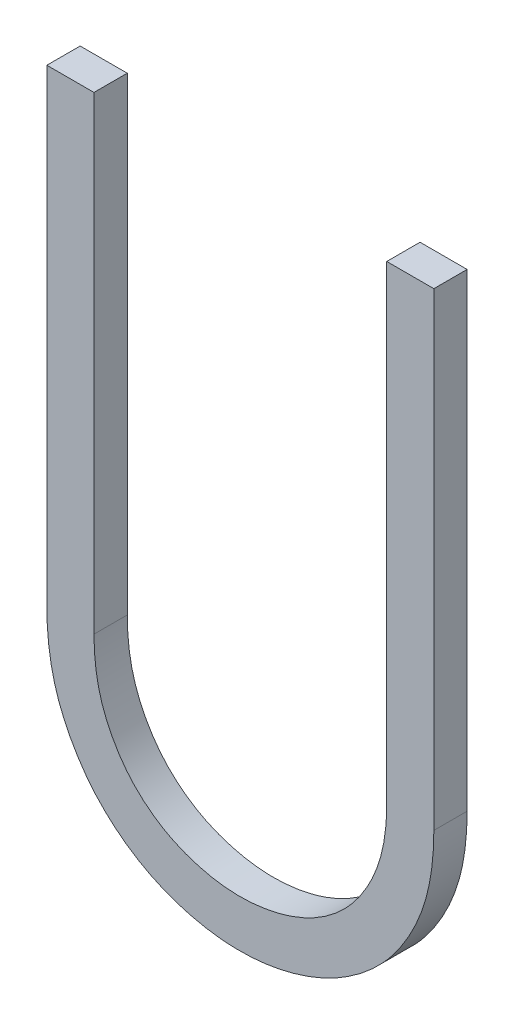
ISO-10303-21;
HEADER;
FILE_DESCRIPTION(('STEP AP214'),'2;1');
FILE_NAME('part.step','',(''),(''),'','','');
FILE_SCHEMA(('AUTOMOTIVE_DESIGN { 1 0 10303 214 1 1 1 1 }'));
ENDSEC;
DATA;
#1=APPLICATION_CONTEXT('core data for automotive mechanical design processes');
#2=APPLICATION_PROTOCOL_DEFINITION('international standard','automotive_design',2000,#1);
#3=PRODUCT_CONTEXT('',#1,'mechanical');
#4=PRODUCT('Part','Part','',(#3));
#5=PRODUCT_RELATED_PRODUCT_CATEGORY('part','',(#4));
#6=PRODUCT_DEFINITION_FORMATION('','',#4);
#7=PRODUCT_DEFINITION_CONTEXT('part definition',#1,'design');
#8=PRODUCT_DEFINITION('design','',#6,#7);
#9=PRODUCT_DEFINITION_SHAPE('','',#8);
#10=(LENGTH_UNIT() NAMED_UNIT(*) SI_UNIT(.MILLI.,.METRE.));
#11=(NAMED_UNIT(*) PLANE_ANGLE_UNIT() SI_UNIT($,.RADIAN.));
#12=(NAMED_UNIT(*) SI_UNIT($,.STERADIAN.) SOLID_ANGLE_UNIT());
#13=UNCERTAINTY_MEASURE_WITH_UNIT(LENGTH_MEASURE(1.E-05),#10,'distance_accuracy_value','');
#14=(GEOMETRIC_REPRESENTATION_CONTEXT(3) GLOBAL_UNCERTAINTY_ASSIGNED_CONTEXT((#13)) GLOBAL_UNIT_ASSIGNED_CONTEXT((#10,
#11,#12)) REPRESENTATION_CONTEXT('',''));
#15=CARTESIAN_POINT('',(0.,0.,0.));
#16=DIRECTION('',(0.,0.,1.));
#17=DIRECTION('',(1.,0.,0.));
#18=AXIS2_PLACEMENT_3D('',#15,#16,#17);
#19=CARTESIAN_POINT('',(92.5469384686771,61.768082354778,-39.1));
#20=DIRECTION('',(0.,0.,-1.));
#21=DIRECTION('',(-1.,0.,0.));
#22=AXIS2_PLACEMENT_3D('',#19,#20,#21);
#23=PLANE('',#22);
#24=DIRECTION('',(0.,1.,0.));
#25=VECTOR('',#24,1.);
#26=CARTESIAN_POINT('',(93.1284643788903,62.3727971944111,-39.1));
#27=LINE('',#26,#25);
#28=CARTESIAN_POINT('',(93.1284643788903,63.7819511472511,-39.1));
#29=VERTEX_POINT('',#28);
#30=CARTESIAN_POINT('',(93.1284643788903,62.3727971944111,-39.1));
#31=VERTEX_POINT('',#30);
#32=EDGE_CURVE('E111',#29,#31,#27,.F.);
#33=ORIENTED_EDGE('',*,*,#32,.T.);
#34=CARTESIAN_POINT('',(93.1284643788903,62.3727971944111,-39.1));
#35=CARTESIAN_POINT('',(93.128464612406,62.3559610228039,-39.1));
#36=CARTESIAN_POINT('',(93.1279891828892,62.3391170753176,-39.1));
#37=CARTESIAN_POINT('',(93.1259681334556,62.3054891550443,-39.1));
#38=CARTESIAN_POINT('',(93.1244221550853,62.2887052042387,-39.1));
#39=CARTESIAN_POINT('',(93.1201313363732,62.2552088745833,-39.1));
#40=CARTESIAN_POINT('',(93.117381123898,62.2384971592916,-39.1));
#41=CARTESIAN_POINT('',(93.1104808841553,62.2053813349353,-39.1));
#42=CARTESIAN_POINT('',(93.1063326104776,62.1889768675648,-39.1));
#43=CARTESIAN_POINT('',(93.0965078825521,62.1564927964447,-39.1));
#44=CARTESIAN_POINT('',(93.0908198944745,62.1404166718114,-39.1));
#45=CARTESIAN_POINT('',(93.0780084153976,62.1088338777515,-39.1));
#46=CARTESIAN_POINT('',(93.0708837870614,62.09332767108,-39.1));
#47=CARTESIAN_POINT('',(93.0553284867407,62.0630312545081,-39.1));
#48=CARTESIAN_POINT('',(93.0469007078827,62.0482395515642,-39.1));
#49=CARTESIAN_POINT('',(93.0288450225817,62.0194146253009,-39.1));
#50=CARTESIAN_POINT('',(93.0192177577168,62.0053810022113,-39.1));
#51=CARTESIAN_POINT('',(92.9991350311018,61.9789360156499,-39.1));
#52=CARTESIAN_POINT('',(92.9887393628267,61.9664794767565,-39.1));
#53=CARTESIAN_POINT('',(92.9668482845252,61.9425749980376,-39.1));
#54=CARTESIAN_POINT('',(92.9553527910697,61.9311271348535,-39.1));
#55=CARTESIAN_POINT('',(92.931417153432,61.9092694809057,-39.1));
#56=CARTESIAN_POINT('',(92.9189770224618,61.8988596756281,-39.1));
#57=CARTESIAN_POINT('',(92.893262100626,61.8791121743474,-39.1));
#58=CARTESIAN_POINT('',(92.8799868224904,61.8697751133899,-39.1));
#59=CARTESIAN_POINT('',(92.8532547174539,61.8526104279979,-39.1));
#60=CARTESIAN_POINT('',(92.8398275888469,61.8447366479966,-39.1));
#61=CARTESIAN_POINT('',(92.8123479241951,61.8301570997244,-39.1));
#62=CARTESIAN_POINT('',(92.798295169639,61.8234517436292,-39.1));
#63=CARTESIAN_POINT('',(92.7697022844461,61.8111697438613,-39.1));
#64=CARTESIAN_POINT('',(92.7551620231869,61.8055934055604,-39.1));
#65=CARTESIAN_POINT('',(92.7257062842066,61.7955535969967,-39.1));
#66=CARTESIAN_POINT('',(92.7107907973868,61.7910901537489,-39.1));
#67=CARTESIAN_POINT('',(92.6638440054557,61.778971256608,-39.1));
#68=CARTESIAN_POINT('',(92.6312710912322,61.7733054493397,-39.1));
#69=CARTESIAN_POINT('',(92.5656332714684,61.7674747837131,-39.1));
#70=CARTESIAN_POINT('',(92.5325683781739,61.7673097886634,-39.1));
#71=CARTESIAN_POINT('',(92.482966103109,61.7711726920112,-39.1));
#72=CARTESIAN_POINT('',(92.4662494243451,61.7731907026262,-39.1));
#73=CARTESIAN_POINT('',(92.4330417107069,61.7786377304,-39.1));
#74=CARTESIAN_POINT('',(92.4165507058026,61.7820669331256,-39.1));
#75=CARTESIAN_POINT('',(92.383900743464,61.7902621414913,-39.1));
#76=CARTESIAN_POINT('',(92.3677418993367,61.7950285954336,-39.1));
#77=CARTESIAN_POINT('',(92.3358700675821,61.8058678802424,-39.1));
#78=CARTESIAN_POINT('',(92.3201570034842,61.8119404854947,-39.1));
#79=CARTESIAN_POINT('',(92.2891378120689,61.8255128059834,-39.1));
#80=CARTESIAN_POINT('',(92.2738385025005,61.8330282300943,-39.1));
#81=CARTESIAN_POINT('',(92.2440231471033,61.849483306961,-39.1));
#82=CARTESIAN_POINT('',(92.2295071990375,61.858423136934,-39.1));
#83=CARTESIAN_POINT('',(92.2013592750524,61.8775718225582,-39.1));
#84=CARTESIAN_POINT('',(92.1877265244775,61.8877795425662,-39.1));
#85=CARTESIAN_POINT('',(92.1614521423162,61.9093974587848,-39.1));
#86=CARTESIAN_POINT('',(92.1488103508913,61.9208074603724,-39.1));
#87=CARTESIAN_POINT('',(92.1256633258928,61.9437437820867,-39.1));
#88=CARTESIAN_POINT('',(92.1150678188181,61.9551789642454,-39.1));
#89=CARTESIAN_POINT('',(92.0949386801385,61.9789471721373,-39.1));
#90=CARTESIAN_POINT('',(92.0854049799097,61.9912801397618,-39.1));
#91=CARTESIAN_POINT('',(92.067394872686,62.0166858610574,-39.1));
#92=CARTESIAN_POINT('',(92.0589181450619,62.0297583886275,-39.1));
#93=CARTESIAN_POINT('',(92.0429520399606,62.056489904101,-39.1));
#94=CARTESIAN_POINT('',(92.0354629174173,62.0701490422266,-39.1));
#95=CARTESIAN_POINT('',(92.0142816860538,62.1127175245262,-39.1));
#96=CARTESIAN_POINT('',(92.0023533166285,62.1425519956378,-39.1));
#97=CARTESIAN_POINT('',(91.9884829559134,62.1884739050831,-39.1));
#98=CARTESIAN_POINT('',(91.9845286846697,62.2039860697985,-39.1));
#99=CARTESIAN_POINT('',(91.9778825541651,62.2352795321276,-39.1));
#100=CARTESIAN_POINT('',(91.9751907309663,62.251060837416,-39.1));
#101=CARTESIAN_POINT('',(91.9706609308811,62.2844805898403,-39.1));
#102=CARTESIAN_POINT('',(91.9689468483553,62.3021352303027,-39.1));
#103=CARTESIAN_POINT('',(91.9667139858682,62.3374624856035,-39.1));
#104=CARTESIAN_POINT('',(91.9661912408522,62.3551348443925,-39.1));
#105=CARTESIAN_POINT('',(91.9661897602903,62.3727971944111,-39.1));
#106=B_SPLINE_CURVE_WITH_KNOTS('',3,(#34,#35,#36,#37,#38,#39,#40,#41,#42,#43,#44,#45,#46,#47,
#48,#49,#50,#51,#52,#53,#54,#55,#56,#57,#58,#59,#60,#61,#62,#63,#64,#65,#66,#67,#68,#69,#70,#71,
#72,#73,#74,#75,#76,#77,#78,#79,#80,#81,#82,#83,#84,#85,#86,#87,#88,#89,#90,#91,#92,#93,#94,#95,
#96,#97,#98,#99,#100,#101,#102,#103,#104,#105),.UNSPECIFIED.,.F.,.F.,(4,2,2,2,2,2,2,2,2,2,2,2,2,
2,2,2,2,2,2,2,2,2,2,2,2,2,2,2,2,2,2,2,2,2,2,4),(0.,0.0505131126021044,0.101043146770105,
0.151800931149548,0.20249528547167,0.253580429140989,0.304706175009595,0.355720004416848,
0.406706663872336,0.455308685788363,0.503914397413702,0.55251942935277,0.601153087947299,
0.647795101440344,0.694453535308416,0.741124572335233,0.787796742165514,0.886506132827456,
0.985213070631072,1.03567639126356,1.08614634977205,1.1366332481707,1.18711143285614,
1.23817404723261,1.28924301952228,1.34026657503558,1.39128188360503,1.43799042280603,
1.48469594151162,1.53138725760076,1.57809060278417,1.67393094600677,1.72190973269508,
1.76988988982616,1.82306131187261,1.87605550670264),.UNSPECIFIED.);
#107=CARTESIAN_POINT('',(91.9661897602903,62.3727971944111,-39.1));
#108=VERTEX_POINT('',#107);
#109=EDGE_CURVE('E84',#31,#108,#106,.T.);
#110=ORIENTED_EDGE('',*,*,#109,.T.);
#111=DIRECTION('',(0.,1.,0.));
#112=VECTOR('',#111,1.);
#113=CARTESIAN_POINT('',(91.9661897602903,61.768082354778,-39.1));
#114=LINE('',#113,#112);
#115=CARTESIAN_POINT('',(91.9661897602903,63.7819511472511,-39.1));
#116=VERTEX_POINT('',#115);
#117=EDGE_CURVE('E82',#108,#116,#114,.T.);
#118=ORIENTED_EDGE('',*,*,#117,.T.);
#119=DIRECTION('',(1.,0.,0.));
#120=VECTOR('',#119,1.);
#121=CARTESIAN_POINT('',(92.1076599405903,63.7819511472511,-39.1));
#122=LINE('',#121,#120);
#123=CARTESIAN_POINT('',(92.1076599405903,63.7819511472511,-39.1));
#124=VERTEX_POINT('',#123);
#125=EDGE_CURVE('E78',#116,#124,#122,.T.);
#126=ORIENTED_EDGE('',*,*,#125,.T.);
#127=DIRECTION('',(0.,1.,0.));
#128=VECTOR('',#127,1.);
#129=CARTESIAN_POINT('',(92.1076599405903,62.3727971944111,-39.1));
#130=LINE('',#129,#128);
#131=CARTESIAN_POINT('',(92.1076599405903,62.3727971944111,-39.1));
#132=VERTEX_POINT('',#131);
#133=EDGE_CURVE('E72',#124,#132,#130,.F.);
#134=ORIENTED_EDGE('',*,*,#133,.T.);
#135=CARTESIAN_POINT('',(92.1076599405903,62.3727971944111,-39.1));
#136=CARTESIAN_POINT('',(92.1076789981272,62.3558384894153,-39.1));
#137=CARTESIAN_POINT('',(92.1082609739383,62.3388574954336,-39.1));
#138=CARTESIAN_POINT('',(92.1108215180757,62.3049362087749,-39.1));
#139=CARTESIAN_POINT('',(92.112805694954,62.2879963546022,-39.1));
#140=CARTESIAN_POINT('',(92.1184558302516,62.2543202873392,-39.1));
#141=CARTESIAN_POINT('',(92.1221278914652,62.2375850414001,-39.1));
#142=CARTESIAN_POINT('',(92.1314507900277,62.204703382027,-39.1));
#143=CARTESIAN_POINT('',(92.1370976273427,62.1885558505962,-39.1));
#144=CARTESIAN_POINT('',(92.148232906288,62.1618146888392,-39.1));
#145=CARTESIAN_POINT('',(92.1532506466588,62.1510210584086,-39.1));
#146=CARTESIAN_POINT('',(92.164117073467,62.1298511205019,-39.1));
#147=CARTESIAN_POINT('',(92.1699663581348,62.1194751204342,-39.1));
#148=CARTESIAN_POINT('',(92.1824037498419,62.099212867842,-39.1));
#149=CARTESIAN_POINT('',(92.1889897497277,62.0893253295175,-39.1));
#150=CARTESIAN_POINT('',(92.2029923024783,62.0701689258503,-39.1));
#151=CARTESIAN_POINT('',(92.2104082031219,62.0608995836835,-39.1));
#152=CARTESIAN_POINT('',(92.2339908745917,62.0340822003594,-39.1));
#153=CARTESIAN_POINT('',(92.2514344295387,62.0176226849092,-39.1));
#154=CARTESIAN_POINT('',(92.2795032762778,61.9954121340389,-39.1));
#155=CARTESIAN_POINT('',(92.2891870096989,61.9884162237661,-39.1));
#156=CARTESIAN_POINT('',(92.3091161819004,61.9752757077272,-39.1));
#157=CARTESIAN_POINT('',(92.3193612902052,61.9691306084553,-39.1));
#158=CARTESIAN_POINT('',(92.3398258621346,61.9580996761413,-39.1));
#159=CARTESIAN_POINT('',(92.3500191452628,61.9531650905835,-39.1));
#160=CARTESIAN_POINT('',(92.3707697385443,61.9441288415465,-39.1));
#161=CARTESIAN_POINT('',(92.3813271777594,61.9400274769952,-39.1));
#162=CARTESIAN_POINT('',(92.4027048127613,61.9325813054758,-39.1));
#163=CARTESIAN_POINT('',(92.4135250315432,61.9292365649833,-39.1));
#164=CARTESIAN_POINT('',(92.4353661785707,61.9232876570716,-39.1));
#165=CARTESIAN_POINT('',(92.4463871030346,61.9206834757134,-39.1));
#166=CARTESIAN_POINT('',(92.4700779752161,61.9159460584293,-39.1));
#167=CARTESIAN_POINT('',(92.4827705109812,61.9139231272964,-39.1));
#168=CARTESIAN_POINT('',(92.5082801207616,61.9109904937692,-39.1));
#169=CARTESIAN_POINT('',(92.5210971798394,61.9100806594718,-39.1));
#170=CARTESIAN_POINT('',(92.5596004421889,61.9090174681615,-39.1));
#171=CARTESIAN_POINT('',(92.585349644283,61.9105282189676,-39.1));
#172=CARTESIAN_POINT('',(92.6361651503735,61.9176555332605,-39.1));
#173=CARTESIAN_POINT('',(92.661233053235,61.923261430938,-39.1));
#174=CARTESIAN_POINT('',(92.7102228492542,61.9382912977695,-39.1));
#175=CARTESIAN_POINT('',(92.7341454583794,61.9477128458198,-39.1));
#176=CARTESIAN_POINT('',(92.7802714132852,61.9712576177516,-39.1));
#177=CARTESIAN_POINT('',(92.8024229907752,61.9854833444715,-39.1));
#178=CARTESIAN_POINT('',(92.8436663435529,62.0178444081711,-39.1));
#179=CARTESIAN_POINT('',(92.8627591423771,62.0359784325625,-39.1));
#180=CARTESIAN_POINT('',(92.894473651437,62.0730424727731,-39.1));
#181=CARTESIAN_POINT('',(92.9076226651519,62.0915271329504,-39.1));
#182=CARTESIAN_POINT('',(92.9311483056162,62.1301597856754,-39.1));
#183=CARTESIAN_POINT('',(92.9415259015216,62.1503071935307,-39.1));
#184=CARTESIAN_POINT('',(92.9550619294097,62.1824435569383,-39.1));
#185=CARTESIAN_POINT('',(92.9593536471576,62.1939598622023,-39.1));
#186=CARTESIAN_POINT('',(92.9669358839226,62.2173177403139,-39.1));
#187=CARTESIAN_POINT('',(92.9702263410901,62.2291593332059,-39.1));
#188=CARTESIAN_POINT('',(92.9786285158555,62.2650312106342,-39.1));
#189=CARTESIAN_POINT('',(92.98227203586,62.2894110066692,-39.1));
#190=CARTESIAN_POINT('',(92.9853236763738,62.3236920475392,-39.1));
#191=CARTESIAN_POINT('',(92.985961517582,62.3335201626765,-39.1));
#192=CARTESIAN_POINT('',(92.9867971990121,62.3531629993325,-39.1));
#193=CARTESIAN_POINT('',(92.986996477432,62.3629776588295,-39.1));
#194=CARTESIAN_POINT('',(92.9869941985903,62.3727971944111,-39.1));
#195=B_SPLINE_CURVE_WITH_KNOTS('',3,(#135,#136,#137,#138,#139,#140,#141,#142,#143,#144,#145,
#146,#147,#148,#149,#150,#151,#152,#153,#154,#155,#156,#157,#158,#159,#160,#161,#162,#163,#164,
#165,#166,#167,#168,#169,#170,#171,#172,#173,#174,#175,#176,#177,#178,#179,#180,#181,#182,#183,
#184,#185,#186,#187,#188,#189,#190,#191,#192,#193,#194),.UNSPECIFIED.,.F.,.F.,(4,2,2,2,2,2,2,2,
2,2,2,2,2,2,2,2,2,2,2,2,2,2,2,2,2,2,2,2,2,4),(0.,0.0509009811380191,0.102006717882854,
0.153298706298225,0.204487395630813,0.240161761465519,0.275861923301043,0.311462467447496,
0.347035226956435,0.418517242261074,0.454326971074864,0.490115840949116,0.524050197655469,
0.55799670730169,0.591946198275354,0.625895050201771,0.66440574238388,0.702911870571285,
0.77989117694182,0.856670702327828,0.933401585764448,1.01188556774298,1.09034323210703,
1.15810747598678,1.22584799180842,1.26267542070807,1.29950512403607,1.3731567982994,
1.40269968908229,1.43214555330972),.UNSPECIFIED.);
#196=CARTESIAN_POINT('',(92.9869941985903,62.3727971944111,-39.1));
#197=VERTEX_POINT('',#196);
#198=EDGE_CURVE('E24',#132,#197,#195,.T.);
#199=ORIENTED_EDGE('',*,*,#198,.T.);
#200=DIRECTION('',(0.,1.,0.));
#201=VECTOR('',#200,1.);
#202=CARTESIAN_POINT('',(92.9869941985903,63.7819511472511,-39.1));
#203=LINE('',#202,#201);
#204=CARTESIAN_POINT('',(92.9869941985903,63.7819511472511,-39.1));
#205=VERTEX_POINT('',#204);
#206=EDGE_CURVE('E128',#197,#205,#203,.T.);
#207=ORIENTED_EDGE('',*,*,#206,.T.);
#208=DIRECTION('',(1.,0.,0.));
#209=VECTOR('',#208,1.);
#210=CARTESIAN_POINT('',(93.1284643788903,63.7819511472511,-39.1));
#211=LINE('',#210,#209);
#212=EDGE_CURVE('E115',#205,#29,#211,.T.);
#213=ORIENTED_EDGE('',*,*,#212,.T.);
#214=EDGE_LOOP('',(#33,#110,#118,#126,#134,#199,#207,#213));
#215=FACE_BOUND('',#214,.T.);
#216=ADVANCED_FACE('F17',(#215),#23,.T.);
#217=CARTESIAN_POINT('',(92.1076599405903,63.7819511472511,-39.));
#218=DIRECTION('',(0.,-1.,0.));
#219=DIRECTION('',(0.,0.,-1.));
#220=AXIS2_PLACEMENT_3D('',#217,#218,#219);
#221=PLANE('',#220);
#222=DIRECTION('',(0.,0.,-1.));
#223=VECTOR('',#222,1.);
#224=CARTESIAN_POINT('',(91.9661897602903,63.7819511472511,-39.));
#225=LINE('',#224,#223);
#226=CARTESIAN_POINT('',(91.9661897602903,63.7819511472511,-39.));
#227=VERTEX_POINT('',#226);
#228=EDGE_CURVE('E92',#116,#227,#225,.F.);
#229=ORIENTED_EDGE('',*,*,#228,.T.);
#230=DIRECTION('',(-1.,0.,0.));
#231=VECTOR('',#230,1.);
#232=CARTESIAN_POINT('',(92.5469384686771,63.7819511472511,-39.));
#233=LINE('',#232,#231);
#234=CARTESIAN_POINT('',(92.1076599405903,63.7819511472511,-39.));
#235=VERTEX_POINT('',#234);
#236=EDGE_CURVE('E98',#227,#235,#233,.F.);
#237=ORIENTED_EDGE('',*,*,#236,.T.);
#238=DIRECTION('',(0.,0.,1.));
#239=VECTOR('',#238,1.);
#240=CARTESIAN_POINT('',(92.1076599405903,63.7819511472511,-39.));
#241=LINE('',#240,#239);
#242=EDGE_CURVE('E94',#235,#124,#241,.F.);
#243=ORIENTED_EDGE('',*,*,#242,.T.);
#244=ORIENTED_EDGE('',*,*,#125,.F.);
#245=EDGE_LOOP('',(#229,#237,#243,#244));
#246=FACE_BOUND('',#245,.T.);
#247=ADVANCED_FACE('F90',(#246),#221,.F.);
#248=CARTESIAN_POINT('',(92.1076599405903,62.3727971944111,-39.));
#249=DIRECTION('',(-1.,0.,0.));
#250=DIRECTION('',(0.,0.,1.));
#251=AXIS2_PLACEMENT_3D('',#248,#249,#250);
#252=PLANE('',#251);
#253=ORIENTED_EDGE('',*,*,#242,.F.);
#254=DIRECTION('',(0.,1.,0.));
#255=VECTOR('',#254,1.);
#256=CARTESIAN_POINT('',(92.1076599405903,61.768082354778,-39.));
#257=LINE('',#256,#255);
#258=CARTESIAN_POINT('',(92.1076599405903,62.3727971944111,-39.));
#259=VERTEX_POINT('',#258);
#260=EDGE_CURVE('E106',#235,#259,#257,.F.);
#261=ORIENTED_EDGE('',*,*,#260,.T.);
#262=DIRECTION('',(0.,0.,-1.));
#263=VECTOR('',#262,1.);
#264=CARTESIAN_POINT('',(92.1076599405903,62.3727971944111,-39.05));
#265=LINE('',#264,#263);
#266=EDGE_CURVE('E134',#259,#132,#265,.T.);
#267=ORIENTED_EDGE('',*,*,#266,.T.);
#268=ORIENTED_EDGE('',*,*,#133,.F.);
#269=EDGE_LOOP('',(#253,#261,#267,#268));
#270=FACE_BOUND('',#269,.T.);
#271=ADVANCED_FACE('F191',(#270),#252,.F.);
#272=CARTESIAN_POINT('',(92.9869941985903,62.3727971944111,-39.));
#273=CARTESIAN_POINT('',(92.9869941985903,62.3727971944111,-39.1));
#274=CARTESIAN_POINT('',(92.9869941985903,62.3474314733611,-39.));
#275=CARTESIAN_POINT('',(92.9869941985903,62.3474314733611,-39.1));
#276=CARTESIAN_POINT('',(92.9844516341903,62.2986452045111,-39.));
#277=CARTESIAN_POINT('',(92.9844516341903,62.2986452045111,-39.1));
#278=CARTESIAN_POINT('',(92.9718587119903,62.2289848071911,-39.));
#279=CARTESIAN_POINT('',(92.9718587119903,62.2289848071911,-39.1));
#280=CARTESIAN_POINT('',(92.9500480645903,62.1666240285311,-39.));
#281=CARTESIAN_POINT('',(92.9500480645903,62.1666240285311,-39.1));
#282=CARTESIAN_POINT('',(92.9212677967903,62.1115059303311,-39.));
#283=CARTESIAN_POINT('',(92.9212677967903,62.1115059303311,-39.1));
#284=CARTESIAN_POINT('',(92.8874423864903,62.0627878716211,-39.));
#285=CARTESIAN_POINT('',(92.8874423864903,62.0627878716211,-39.1));
#286=CARTESIAN_POINT('',(92.8480952942903,62.0211861683711,-39.));
#287=CARTESIAN_POINT('',(92.8480952942903,62.0211861683711,-39.1));
#288=CARTESIAN_POINT('',(92.8043264813903,61.9863464067611,-39.));
#289=CARTESIAN_POINT('',(92.8043264813903,61.9863464067611,-39.1));
#290=CARTESIAN_POINT('',(92.7567744393903,61.9578109685211,-39.));
#291=CARTESIAN_POINT('',(92.7567744393903,61.9578109685211,-39.1));
#292=CARTESIAN_POINT('',(92.7058712104903,61.9362960147211,-39.));
#293=CARTESIAN_POINT('',(92.7058712104903,61.9362960147211,-39.1));
#294=CARTESIAN_POINT('',(92.6531627209903,61.9209964694111,-39.));
#295=CARTESIAN_POINT('',(92.6531627209903,61.9209964694111,-39.1));
#296=CARTESIAN_POINT('',(92.5996696579903,61.9116223399711,-39.));
#297=CARTESIAN_POINT('',(92.5996696579903,61.9116223399711,-39.1));
#298=CARTESIAN_POINT('',(92.5464532247903,61.9085184032511,-39.));
#299=CARTESIAN_POINT('',(92.5464532247903,61.9085184032511,-39.1));
#300=CARTESIAN_POINT('',(92.4935405572903,61.9116397945211,-39.));
#301=CARTESIAN_POINT('',(92.4935405572903,61.9116397945211,-39.1));
#302=CARTESIAN_POINT('',(92.4409871583903,61.9210790233511,-39.));
#303=CARTESIAN_POINT('',(92.4409871583903,61.9210790233511,-39.1));
#304=CARTESIAN_POINT('',(92.3886974774903,61.9363488171011,-39.));
#305=CARTESIAN_POINT('',(92.3886974774903,61.9363488171011,-39.1));
#306=CARTESIAN_POINT('',(92.3378781931903,61.9578071502211,-39.));
#307=CARTESIAN_POINT('',(92.3378781931903,61.9578071502211,-39.1));
#308=CARTESIAN_POINT('',(92.2903280652903,61.9863474397011,-39.));
#309=CARTESIAN_POINT('',(92.2903280652903,61.9863474397011,-39.1));
#310=CARTESIAN_POINT('',(92.2465587326903,62.0211858838911,-39.));
#311=CARTESIAN_POINT('',(92.2465587326903,62.0211858838911,-39.1));
#312=CARTESIAN_POINT('',(92.2072117840903,62.0627879513311,-39.));
#313=CARTESIAN_POINT('',(92.2072117840903,62.0627879513311,-39.1));
#314=CARTESIAN_POINT('',(92.1733863333903,62.1115059074511,-39.));
#315=CARTESIAN_POINT('',(92.1733863333903,62.1115059074511,-39.1));
#316=CARTESIAN_POINT('',(92.1446060771903,62.1666240351911,-39.));
#317=CARTESIAN_POINT('',(92.1446060771903,62.1666240351911,-39.1));
#318=CARTESIAN_POINT('',(92.1227954263903,62.2289848052211,-39.));
#319=CARTESIAN_POINT('',(92.1227954263903,62.2289848052211,-39.1));
#320=CARTESIAN_POINT('',(92.1102025051903,62.2986452051411,-39.));
#321=CARTESIAN_POINT('',(92.1102025051903,62.2986452051411,-39.1));
#322=CARTESIAN_POINT('',(92.1076599405903,62.3474314733611,-39.));
#323=CARTESIAN_POINT('',(92.1076599405903,62.3474314733611,-39.1));
#324=CARTESIAN_POINT('',(92.1076599405903,62.3727971944111,-39.));
#325=CARTESIAN_POINT('',(92.1076599405903,62.3727971944111,-39.1));
#326=B_SPLINE_SURFACE_WITH_KNOTS('',3,1,((#272,#273),(#274,#275),(#276,#277),(#278,#279),(#280,
#281),(#282,#283),(#284,#285),(#286,#287),(#288,#289),(#290,#291),(#292,#293),(#294,#295),(#296,
#297),(#298,#299),(#300,#301),(#302,#303),(#304,#305),(#306,#307),(#308,#309),(#310,#311),(#312,
#313),(#314,#315),(#316,#317),(#318,#319),(#320,#321),(#322,#323),(#324,#325)),.UNSPECIFIED.,
.F.,.F.,.F.,(4,1,1,1,1,1,1,1,1,1,1,1,1,1,1,1,1,1,1,1,1,1,1,1,4),(2,2),(0.,0.0531350872704,
0.1020767439254,0.1477807877503,0.1909521236719,0.2319702139487,0.271628852714,0.3104488566396,
0.3488152204029,0.3874306662732,0.425876020402,0.4635572154088,0.5009583521422,0.537285267836,
0.5743305417864,0.6125693337268,0.6511847795971,0.6895511433603,0.728371147286,0.7680297860513,
0.8090478763281,0.8522192122497,0.8979232560746,0.94686491272964,1.),(1.,1.1),.UNSPECIFIED.);
#327=CARTESIAN_POINT('',(92.1076599405903,62.3727971944111,-39.));
#328=CARTESIAN_POINT('',(92.1076789981272,62.3558384894153,-39.));
#329=CARTESIAN_POINT('',(92.1082609739383,62.3388574954336,-39.));
#330=CARTESIAN_POINT('',(92.1108215180757,62.3049362087749,-39.));
#331=CARTESIAN_POINT('',(92.112805694954,62.2879963546022,-39.));
#332=CARTESIAN_POINT('',(92.1184558302516,62.2543202873392,-39.));
#333=CARTESIAN_POINT('',(92.1221278914652,62.2375850414001,-39.));
#334=CARTESIAN_POINT('',(92.1314507900277,62.204703382027,-39.));
#335=CARTESIAN_POINT('',(92.1370976273427,62.1885558505962,-39.));
#336=CARTESIAN_POINT('',(92.148232906288,62.1618146888392,-39.));
#337=CARTESIAN_POINT('',(92.1532506466588,62.1510210584086,-39.));
#338=CARTESIAN_POINT('',(92.164117073467,62.129851120502,-39.));
#339=CARTESIAN_POINT('',(92.1699663581348,62.1194751204342,-39.));
#340=CARTESIAN_POINT('',(92.1824037498419,62.099212867842,-39.));
#341=CARTESIAN_POINT('',(92.1889897497277,62.0893253295175,-39.));
#342=CARTESIAN_POINT('',(92.2029923024783,62.0701689258503,-39.));
#343=CARTESIAN_POINT('',(92.2104082031219,62.0608995836835,-39.));
#344=CARTESIAN_POINT('',(92.2339908745917,62.0340822003594,-39.));
#345=CARTESIAN_POINT('',(92.2514344295387,62.0176226849092,-39.));
#346=CARTESIAN_POINT('',(92.2795032762777,61.9954121340389,-39.));
#347=CARTESIAN_POINT('',(92.2891870096989,61.9884162237661,-39.));
#348=CARTESIAN_POINT('',(92.3091161819004,61.9752757077272,-39.));
#349=CARTESIAN_POINT('',(92.3193612902052,61.9691306084553,-39.));
#350=CARTESIAN_POINT('',(92.3398258621346,61.9580996761413,-39.));
#351=CARTESIAN_POINT('',(92.3500191452628,61.9531650905835,-39.));
#352=CARTESIAN_POINT('',(92.3707697385443,61.9441288415465,-39.));
#353=CARTESIAN_POINT('',(92.3813271777594,61.9400274769952,-39.));
#354=CARTESIAN_POINT('',(92.4027048127613,61.9325813054758,-39.));
#355=CARTESIAN_POINT('',(92.4135250315432,61.9292365649833,-39.));
#356=CARTESIAN_POINT('',(92.4353661785707,61.9232876570716,-39.));
#357=CARTESIAN_POINT('',(92.4463871030345,61.9206834757134,-39.));
#358=CARTESIAN_POINT('',(92.4700779752161,61.9159460584293,-39.));
#359=CARTESIAN_POINT('',(92.4827705109812,61.9139231272964,-39.));
#360=CARTESIAN_POINT('',(92.5082801207617,61.9109904937691,-39.));
#361=CARTESIAN_POINT('',(92.5210971798394,61.9100806594718,-39.));
#362=CARTESIAN_POINT('',(92.559600442189,61.9090174681615,-39.));
#363=CARTESIAN_POINT('',(92.5853496442832,61.9105282189677,-39.));
#364=CARTESIAN_POINT('',(92.6361651503737,61.9176555332606,-39.));
#365=CARTESIAN_POINT('',(92.6612330532353,61.9232614309381,-39.));
#366=CARTESIAN_POINT('',(92.7102228492545,61.9382912977696,-39.));
#367=CARTESIAN_POINT('',(92.7341454583797,61.9477128458199,-39.));
#368=CARTESIAN_POINT('',(92.7802714132855,61.9712576177517,-39.));
#369=CARTESIAN_POINT('',(92.8024229907754,61.9854833444716,-39.));
#370=CARTESIAN_POINT('',(92.8436663435531,62.0178444081712,-39.));
#371=CARTESIAN_POINT('',(92.8627591423772,62.0359784325626,-39.));
#372=CARTESIAN_POINT('',(92.8944736514371,62.0730424727731,-39.));
#373=CARTESIAN_POINT('',(92.9076226651519,62.0915271329505,-39.));
#374=CARTESIAN_POINT('',(92.9311483056163,62.1301597856754,-39.));
#375=CARTESIAN_POINT('',(92.9415259015216,62.1503071935307,-39.));
#376=CARTESIAN_POINT('',(92.9550619294097,62.1824435569383,-39.));
#377=CARTESIAN_POINT('',(92.9593536471576,62.1939598622023,-39.));
#378=CARTESIAN_POINT('',(92.9669358839226,62.2173177403139,-39.));
#379=CARTESIAN_POINT('',(92.9702263410901,62.2291593332058,-39.));
#380=CARTESIAN_POINT('',(92.9786285158555,62.2650312106342,-39.));
#381=CARTESIAN_POINT('',(92.98227203586,62.2894110066691,-39.));
#382=CARTESIAN_POINT('',(92.9853236763738,62.3236920475392,-39.));
#383=CARTESIAN_POINT('',(92.985961517582,62.3335201626765,-39.));
#384=CARTESIAN_POINT('',(92.9867971990121,62.3531629993325,-39.));
#385=CARTESIAN_POINT('',(92.986996477432,62.3629776588295,-39.));
#386=CARTESIAN_POINT('',(92.9869941985903,62.3727971944111,-39.));
#387=B_SPLINE_CURVE_WITH_KNOTS('',3,(#327,#328,#329,#330,#331,#332,#333,#334,#335,#336,#337,
#338,#339,#340,#341,#342,#343,#344,#345,#346,#347,#348,#349,#350,#351,#352,#353,#354,#355,#356,
#357,#358,#359,#360,#361,#362,#363,#364,#365,#366,#367,#368,#369,#370,#371,#372,#373,#374,#375,
#376,#377,#378,#379,#380,#381,#382,#383,#384,#385,#386),.UNSPECIFIED.,.F.,.F.,(4,2,2,2,2,2,2,2,
2,2,2,2,2,2,2,2,2,2,2,2,2,2,2,2,2,2,2,2,2,4),(0.,0.0509009811380191,0.102006717882852,
0.153298706298223,0.204487395630812,0.240161761465513,0.275861923301037,0.311462467447499,
0.347035226956434,0.418517242261063,0.454326971074849,0.490115840949114,0.524050197655473,
0.557996707301683,0.591946198275344,0.625895050201757,0.664405742383922,0.702911870571396,
0.779891176942071,0.856670702328129,0.933401585764822,1.01188556774319,1.09034323210711,
1.15810747598685,1.22584799180843,1.26267542070807,1.29950512403606,1.37315679829937,
1.40269968908227,1.43214555330972),.UNSPECIFIED.);
#388=CARTESIAN_POINT('',(92.9869941985903,62.3727971944111,-39.));
#389=VERTEX_POINT('',#388);
#390=EDGE_CURVE('E165',#259,#389,#387,.T.);
#391=DIRECTION('',(0.,0.,-1.));
#392=VECTOR('',#391,1.);
#393=CARTESIAN_POINT('',(92.9869941985903,62.3727971944111,-39.));
#394=LINE('',#393,#392);
#395=EDGE_CURVE('E131',#389,#197,#394,.T.);
#396=ORIENTED_EDGE('',*,*,#266,.F.);
#397=ORIENTED_EDGE('',*,*,#390,.T.);
#398=ORIENTED_EDGE('',*,*,#395,.T.);
#399=ORIENTED_EDGE('',*,*,#198,.F.);
#400=EDGE_LOOP('',(#396,#397,#398,#399));
#401=FACE_BOUND('',#400,.T.);
#402=ADVANCED_FACE('F189',(#401),#326,.F.);
#403=CARTESIAN_POINT('',(92.9869941985903,63.7819511472511,-39.));
#404=DIRECTION('',(1.,0.,0.));
#405=DIRECTION('',(0.,0.,-1.));
#406=AXIS2_PLACEMENT_3D('',#403,#404,#405);
#407=PLANE('',#406);
#408=ORIENTED_EDGE('',*,*,#395,.F.);
#409=DIRECTION('',(0.,1.,0.));
#410=VECTOR('',#409,1.);
#411=CARTESIAN_POINT('',(92.9869941985903,61.768082354778,-39.));
#412=LINE('',#411,#410);
#413=CARTESIAN_POINT('',(92.9869941985903,63.7819511472511,-39.));
#414=VERTEX_POINT('',#413);
#415=EDGE_CURVE('E122',#389,#414,#412,.T.);
#416=ORIENTED_EDGE('',*,*,#415,.T.);
#417=DIRECTION('',(0.,0.,-1.));
#418=VECTOR('',#417,1.);
#419=CARTESIAN_POINT('',(92.9869941985903,63.7819511472511,-39.));
#420=LINE('',#419,#418);
#421=EDGE_CURVE('E125',#414,#205,#420,.T.);
#422=ORIENTED_EDGE('',*,*,#421,.T.);
#423=ORIENTED_EDGE('',*,*,#206,.F.);
#424=EDGE_LOOP('',(#408,#416,#422,#423));
#425=FACE_BOUND('',#424,.T.);
#426=ADVANCED_FACE('F185',(#425),#407,.F.);
#427=CARTESIAN_POINT('',(93.1284643788903,63.7819511472511,-39.));
#428=DIRECTION('',(0.,-1.,0.));
#429=DIRECTION('',(0.,0.,-1.));
#430=AXIS2_PLACEMENT_3D('',#427,#428,#429);
#431=PLANE('',#430);
#432=ORIENTED_EDGE('',*,*,#421,.F.);
#433=DIRECTION('',(-1.,0.,0.));
#434=VECTOR('',#433,1.);
#435=CARTESIAN_POINT('',(92.5469384686771,63.7819511472511,-39.));
#436=LINE('',#435,#434);
#437=CARTESIAN_POINT('',(93.1284643788903,63.7819511472511,-39.));
#438=VERTEX_POINT('',#437);
#439=EDGE_CURVE('E118',#414,#438,#436,.F.);
#440=ORIENTED_EDGE('',*,*,#439,.T.);
#441=DIRECTION('',(0.,0.,1.));
#442=VECTOR('',#441,1.);
#443=CARTESIAN_POINT('',(93.1284643788903,63.7819511472511,-39.));
#444=LINE('',#443,#442);
#445=EDGE_CURVE('E112',#438,#29,#444,.F.);
#446=ORIENTED_EDGE('',*,*,#445,.T.);
#447=ORIENTED_EDGE('',*,*,#212,.F.);
#448=EDGE_LOOP('',(#432,#440,#446,#447));
#449=FACE_BOUND('',#448,.T.);
#450=ADVANCED_FACE('F181',(#449),#431,.F.);
#451=CARTESIAN_POINT('',(93.1284643788903,62.3727971944111,-39.));
#452=DIRECTION('',(-1.,0.,0.));
#453=DIRECTION('',(0.,0.,1.));
#454=AXIS2_PLACEMENT_3D('',#451,#452,#453);
#455=PLANE('',#454);
#456=ORIENTED_EDGE('',*,*,#445,.F.);
#457=DIRECTION('',(0.,1.,0.));
#458=VECTOR('',#457,1.);
#459=CARTESIAN_POINT('',(93.1284643788903,61.768082354778,-39.));
#460=LINE('',#459,#458);
#461=CARTESIAN_POINT('',(93.1284643788903,62.3727971944111,-39.));
#462=VERTEX_POINT('',#461);
#463=EDGE_CURVE('E121',#438,#462,#460,.F.);
#464=ORIENTED_EDGE('',*,*,#463,.T.);
#465=DIRECTION('',(0.,0.,-1.));
#466=VECTOR('',#465,1.);
#467=CARTESIAN_POINT('',(93.1284643788903,62.3727971944111,-39.05));
#468=LINE('',#467,#466);
#469=EDGE_CURVE('E100',#462,#31,#468,.T.);
#470=ORIENTED_EDGE('',*,*,#469,.T.);
#471=ORIENTED_EDGE('',*,*,#32,.F.);
#472=EDGE_LOOP('',(#456,#464,#470,#471));
#473=FACE_BOUND('',#472,.T.);
#474=ADVANCED_FACE('F178',(#473),#455,.F.);
#475=CARTESIAN_POINT('',(91.9661897602903,62.3727971944111,-39.));
#476=CARTESIAN_POINT('',(91.9661897602903,62.3727971944111,-39.1));
#477=CARTESIAN_POINT('',(91.9661897602903,62.3408434982611,-39.));
#478=CARTESIAN_POINT('',(91.9661897602903,62.3408434982611,-39.1));
#479=CARTESIAN_POINT('',(91.9694925364903,62.2791655001911,-39.));
#480=CARTESIAN_POINT('',(91.9694925364903,62.2791655001911,-39.1));
#481=CARTESIAN_POINT('',(91.9857527867903,62.1908113684011,-39.));
#482=CARTESIAN_POINT('',(91.9857527867903,62.1908113684011,-39.1));
#483=CARTESIAN_POINT('',(92.0138162791903,62.1110575925311,-39.));
#484=CARTESIAN_POINT('',(92.0138162791903,62.1110575925311,-39.1));
#485=CARTESIAN_POINT('',(92.0510064790903,62.0398441140611,-39.));
#486=CARTESIAN_POINT('',(92.0510064790903,62.0398441140611,-39.1));
#487=CARTESIAN_POINT('',(92.0950710892903,61.9762174359911,-39.));
#488=CARTESIAN_POINT('',(92.0950710892903,61.9762174359911,-39.1));
#489=CARTESIAN_POINT('',(92.1464459528903,61.9210824004611,-39.));
#490=CARTESIAN_POINT('',(92.1464459528903,61.9210824004611,-39.1));
#491=CARTESIAN_POINT('',(92.2037490963903,61.8742071888811,-39.));
#492=CARTESIAN_POINT('',(92.2037490963903,61.8742071888811,-39.1));
#493=CARTESIAN_POINT('',(92.2662093577903,61.8354285067111,-39.));
#494=CARTESIAN_POINT('',(92.2662093577903,61.8354285067111,-39.1));
#495=CARTESIAN_POINT('',(92.3331453337903,61.8055699712811,-39.));
#496=CARTESIAN_POINT('',(92.3331453337903,61.8055699712811,-39.1));
#497=CARTESIAN_POINT('',(92.4028287865903,61.7840527273211,-39.));
#498=CARTESIAN_POINT('',(92.4028287865903,61.7840527273211,-39.1));
#499=CARTESIAN_POINT('',(92.4740634406903,61.7709448388211,-39.));
#500=CARTESIAN_POINT('',(92.4740634406903,61.7709448388211,-39.1));
#501=CARTESIAN_POINT('',(92.5459401585903,61.7666509167411,-39.));
#502=CARTESIAN_POINT('',(92.5459401585903,61.7666509167411,-39.1));
#503=CARTESIAN_POINT('',(92.6178165667903,61.7709454198411,-39.));
#504=CARTESIAN_POINT('',(92.6178165667903,61.7709454198411,-39.1));
#505=CARTESIAN_POINT('',(92.6890521565903,61.7840503830411,-39.));
#506=CARTESIAN_POINT('',(92.6890521565903,61.7840503830411,-39.1));
#507=CARTESIAN_POINT('',(92.7587769969903,61.8055927987811,-39.));
#508=CARTESIAN_POINT('',(92.7587769969903,61.8055927987811,-39.1));
#509=CARTESIAN_POINT('',(92.8258861748903,61.8354893959411,-39.));
#510=CARTESIAN_POINT('',(92.8258861748903,61.8354893959411,-39.1));
#511=CARTESIAN_POINT('',(92.8887749517903,61.8742723653611,-39.));
#512=CARTESIAN_POINT('',(92.8887749517903,61.8742723653611,-39.1));
#513=CARTESIAN_POINT('',(92.9467923504903,61.9210558891211,-39.));
#514=CARTESIAN_POINT('',(92.9467923504903,61.9210558891211,-39.1));
#515=CARTESIAN_POINT('',(92.9989455558903,61.9761046749911,-39.));
#516=CARTESIAN_POINT('',(92.9989455558903,61.9761046749911,-39.1));
#517=CARTESIAN_POINT('',(93.0435040359903,62.0397564887111,-39.));
#518=CARTESIAN_POINT('',(93.0435040359903,62.0397564887111,-39.1));
#519=CARTESIAN_POINT('',(93.0808525780903,62.1110257897211,-39.));
#520=CARTESIAN_POINT('',(93.0808525780903,62.1110257897211,-39.1));
#521=CARTESIAN_POINT('',(93.1088947313903,62.1908141001811,-39.));
#522=CARTESIAN_POINT('',(93.1088947313903,62.1908141001811,-39.1));
#523=CARTESIAN_POINT('',(93.1251637042903,62.2791646330811,-39.));
#524=CARTESIAN_POINT('',(93.1251637042903,62.2791646330811,-39.1));
#525=CARTESIAN_POINT('',(93.1284643788903,62.3408434982611,-39.));
#526=CARTESIAN_POINT('',(93.1284643788903,62.3408434982611,-39.1));
#527=CARTESIAN_POINT('',(93.1284643788903,62.3727971944111,-39.));
#528=CARTESIAN_POINT('',(93.1284643788903,62.3727971944111,-39.1));
#529=B_SPLINE_SURFACE_WITH_KNOTS('',3,1,((#475,#476),(#477,#478),(#479,#480),(#481,#482),(#483,
#484),(#485,#486),(#487,#488),(#489,#490),(#491,#492),(#493,#494),(#495,#496),(#497,#498),(#499,
#500),(#501,#502),(#503,#504),(#505,#506),(#507,#508),(#509,#510),(#511,#512),(#513,#514),(#515,
#516),(#517,#518),(#519,#520),(#521,#522),(#523,#524),(#525,#526),(#527,#528)),.UNSPECIFIED.,
.F.,.F.,.F.,(4,1,1,1,1,1,1,1,1,1,1,1,1,1,1,1,1,1,1,1,1,1,1,1,4),(2,2),(0.,0.0511123757369,
0.0985396102714,0.1432116084355,0.1858064239061,0.2267003961159,0.2666428775128,0.3059388069377,
0.3447937872193,0.3838892109596,0.4228486580279,0.4611904189705,0.4994680287294,0.5377456384884,
0.576087399431,0.6150468464993,0.6542172354135,0.6932819933277,0.7328966380795,0.7731199978872,
0.8141556299852,0.8567883915645,0.90146038972858,0.94888762426312,1.),(1.,1.1),.UNSPECIFIED.);
#530=CARTESIAN_POINT('',(93.1284643788903,62.3727971944111,-39.));
#531=CARTESIAN_POINT('',(93.128464612406,62.3559610228039,-39.));
#532=CARTESIAN_POINT('',(93.1279891828892,62.3391170753176,-39.));
#533=CARTESIAN_POINT('',(93.1259681334556,62.3054891550443,-39.));
#534=CARTESIAN_POINT('',(93.1244221550853,62.2887052042387,-39.));
#535=CARTESIAN_POINT('',(93.1201313363732,62.2552088745833,-39.));
#536=CARTESIAN_POINT('',(93.117381123898,62.2384971592916,-39.));
#537=CARTESIAN_POINT('',(93.1104808841553,62.2053813349352,-39.));
#538=CARTESIAN_POINT('',(93.1063326104776,62.1889768675648,-39.));
#539=CARTESIAN_POINT('',(93.0965078825521,62.1564927964447,-39.));
#540=CARTESIAN_POINT('',(93.0908198944745,62.1404166718114,-39.));
#541=CARTESIAN_POINT('',(93.0780084153976,62.1088338777514,-39.));
#542=CARTESIAN_POINT('',(93.0708837870614,62.09332767108,-39.));
#543=CARTESIAN_POINT('',(93.0553284867407,62.0630312545081,-39.));
#544=CARTESIAN_POINT('',(93.0469007078827,62.0482395515642,-39.));
#545=CARTESIAN_POINT('',(93.0288450225817,62.0194146253009,-39.));
#546=CARTESIAN_POINT('',(93.0192177577168,62.0053810022113,-39.));
#547=CARTESIAN_POINT('',(92.9991350311018,61.97893601565,-39.));
#548=CARTESIAN_POINT('',(92.9887393628267,61.9664794767565,-39.));
#549=CARTESIAN_POINT('',(92.9668482845252,61.9425749980376,-39.));
#550=CARTESIAN_POINT('',(92.9553527910697,61.9311271348535,-39.));
#551=CARTESIAN_POINT('',(92.931417153432,61.9092694809057,-39.));
#552=CARTESIAN_POINT('',(92.9189770224618,61.8988596756281,-39.));
#553=CARTESIAN_POINT('',(92.893262100626,61.8791121743475,-39.));
#554=CARTESIAN_POINT('',(92.8799868224904,61.8697751133899,-39.));
#555=CARTESIAN_POINT('',(92.8532547174539,61.8526104279979,-39.));
#556=CARTESIAN_POINT('',(92.8398275888469,61.8447366479966,-39.));
#557=CARTESIAN_POINT('',(92.8123479241951,61.8301570997244,-39.));
#558=CARTESIAN_POINT('',(92.798295169639,61.8234517436292,-39.));
#559=CARTESIAN_POINT('',(92.7697022844461,61.8111697438613,-39.));
#560=CARTESIAN_POINT('',(92.7551620231869,61.8055934055604,-39.));
#561=CARTESIAN_POINT('',(92.7257062842066,61.7955535969967,-39.));
#562=CARTESIAN_POINT('',(92.7107907973868,61.7910901537489,-39.));
#563=CARTESIAN_POINT('',(92.6638440054557,61.778971256608,-39.));
#564=CARTESIAN_POINT('',(92.6312710912322,61.7733054493398,-39.));
#565=CARTESIAN_POINT('',(92.5656332714686,61.7674747837131,-39.));
#566=CARTESIAN_POINT('',(92.5325683781741,61.7673097886634,-39.));
#567=CARTESIAN_POINT('',(92.4829661031093,61.7711726920112,-39.));
#568=CARTESIAN_POINT('',(92.4662494243453,61.7731907026262,-39.));
#569=CARTESIAN_POINT('',(92.433041710707,61.7786377303999,-39.));
#570=CARTESIAN_POINT('',(92.4165507058028,61.7820669331256,-39.));
#571=CARTESIAN_POINT('',(92.383900743464,61.7902621414913,-39.));
#572=CARTESIAN_POINT('',(92.3677418993368,61.7950285954336,-39.));
#573=CARTESIAN_POINT('',(92.3358700675822,61.8058678802424,-39.));
#574=CARTESIAN_POINT('',(92.3201570034842,61.8119404854947,-39.));
#575=CARTESIAN_POINT('',(92.2891378120688,61.8255128059834,-39.));
#576=CARTESIAN_POINT('',(92.2738385025004,61.8330282300943,-39.));
#577=CARTESIAN_POINT('',(92.244023147103,61.8494833069611,-39.));
#578=CARTESIAN_POINT('',(92.2295071990372,61.8584231369341,-39.));
#579=CARTESIAN_POINT('',(92.201359275052,61.8775718225585,-39.));
#580=CARTESIAN_POINT('',(92.187726524477,61.8877795425665,-39.));
#581=CARTESIAN_POINT('',(92.1614521423157,61.9093974587852,-39.));
#582=CARTESIAN_POINT('',(92.1488103508907,61.9208074603729,-39.));
#583=CARTESIAN_POINT('',(92.1256633258922,61.9437437820872,-39.));
#584=CARTESIAN_POINT('',(92.1150678188176,61.9551789642459,-39.));
#585=CARTESIAN_POINT('',(92.0949386801382,61.9789471721377,-39.));
#586=CARTESIAN_POINT('',(92.0854049799094,61.9912801397621,-39.));
#587=CARTESIAN_POINT('',(92.0673948726858,62.0166858610576,-39.));
#588=CARTESIAN_POINT('',(92.0589181450618,62.0297583886277,-39.));
#589=CARTESIAN_POINT('',(92.0429520399606,62.0564899041011,-39.));
#590=CARTESIAN_POINT('',(92.0354629174173,62.0701490422266,-39.));
#591=CARTESIAN_POINT('',(92.0142816860538,62.1127175245261,-39.));
#592=CARTESIAN_POINT('',(92.0023533166285,62.1425519956377,-39.));
#593=CARTESIAN_POINT('',(91.9884829559134,62.188473905083,-39.));
#594=CARTESIAN_POINT('',(91.9845286846697,62.2039860697985,-39.));
#595=CARTESIAN_POINT('',(91.9778825541651,62.2352795321276,-39.));
#596=CARTESIAN_POINT('',(91.9751907309663,62.251060837416,-39.));
#597=CARTESIAN_POINT('',(91.9706609308811,62.2844805898403,-39.));
#598=CARTESIAN_POINT('',(91.9689468483553,62.3021352303027,-39.));
#599=CARTESIAN_POINT('',(91.9667139858683,62.3374624856035,-39.));
#600=CARTESIAN_POINT('',(91.9661912408522,62.3551348443925,-39.));
#601=CARTESIAN_POINT('',(91.9661897602903,62.3727971944111,-39.));
#602=B_SPLINE_CURVE_WITH_KNOTS('',3,(#530,#531,#532,#533,#534,#535,#536,#537,#538,#539,#540,
#541,#542,#543,#544,#545,#546,#547,#548,#549,#550,#551,#552,#553,#554,#555,#556,#557,#558,#559,
#560,#561,#562,#563,#564,#565,#566,#567,#568,#569,#570,#571,#572,#573,#574,#575,#576,#577,#578,
#579,#580,#581,#582,#583,#584,#585,#586,#587,#588,#589,#590,#591,#592,#593,#594,#595,#596,#597,
#598,#599,#600,#601),.UNSPECIFIED.,.F.,.F.,(4,2,2,2,2,2,2,2,2,2,2,2,2,2,2,2,2,2,2,2,2,2,2,2,2,2,
2,2,2,2,2,2,2,2,2,4),(0.,0.0505131126021044,0.101043146770105,0.151800931149555,
0.20249528547167,0.253580429140998,0.304706175009597,0.355720004416837,0.406706663872338,
0.45530868578836,0.503914397413709,0.552519429352774,0.6011530879473,0.647795101440345,
0.694453535308404,0.741124572335234,0.787796742165526,0.886506132827341,0.98521307063079,
1.03567639126336,1.08614634977193,1.13663324817064,1.18711143285614,1.23817404723281,
1.2892430195227,1.3402665750362,1.39128188360586,1.43799042280662,1.48469594151199,
1.5313872576009,1.57809060278408,1.67393094600675,1.72190973269507,1.76988988982617,
1.82306131187262,1.87605550670264),.UNSPECIFIED.);
#603=CARTESIAN_POINT('',(91.9661897602903,62.3727971944111,-39.));
#604=VERTEX_POINT('',#603);
#605=EDGE_CURVE('E35',#462,#604,#602,.T.);
#606=DIRECTION('',(0.,0.,-1.));
#607=VECTOR('',#606,1.);
#608=CARTESIAN_POINT('',(91.9661897602903,62.3727971944111,-39.));
#609=LINE('',#608,#607);
#610=EDGE_CURVE('E43',#604,#108,#609,.T.);
#611=ORIENTED_EDGE('',*,*,#469,.F.);
#612=ORIENTED_EDGE('',*,*,#605,.T.);
#613=ORIENTED_EDGE('',*,*,#610,.T.);
#614=ORIENTED_EDGE('',*,*,#109,.F.);
#615=EDGE_LOOP('',(#611,#612,#613,#614));
#616=FACE_BOUND('',#615,.T.);
#617=ADVANCED_FACE('F19',(#616),#529,.F.);
#618=CARTESIAN_POINT('',(91.9661897602903,63.7819511472511,-39.));
#619=DIRECTION('',(1.,0.,0.));
#620=DIRECTION('',(0.,0.,-1.));
#621=AXIS2_PLACEMENT_3D('',#618,#619,#620);
#622=PLANE('',#621);
#623=ORIENTED_EDGE('',*,*,#610,.F.);
#624=DIRECTION('',(0.,1.,0.));
#625=VECTOR('',#624,1.);
#626=CARTESIAN_POINT('',(91.9661897602903,61.768082354778,-39.));
#627=LINE('',#626,#625);
#628=EDGE_CURVE('E11',#604,#227,#627,.T.);
#629=ORIENTED_EDGE('',*,*,#628,.T.);
#630=ORIENTED_EDGE('',*,*,#228,.F.);
#631=ORIENTED_EDGE('',*,*,#117,.F.);
#632=EDGE_LOOP('',(#623,#629,#630,#631));
#633=FACE_BOUND('',#632,.T.);
#634=ADVANCED_FACE('F96',(#633),#622,.F.);
#635=CARTESIAN_POINT('',(92.5469384686771,61.768082354778,-39.));
#636=DIRECTION('',(0.,0.,-1.));
#637=DIRECTION('',(-1.,0.,0.));
#638=AXIS2_PLACEMENT_3D('',#635,#636,#637);
#639=PLANE('',#638);
#640=ORIENTED_EDGE('',*,*,#605,.F.);
#641=ORIENTED_EDGE('',*,*,#463,.F.);
#642=ORIENTED_EDGE('',*,*,#439,.F.);
#643=ORIENTED_EDGE('',*,*,#415,.F.);
#644=ORIENTED_EDGE('',*,*,#390,.F.);
#645=ORIENTED_EDGE('',*,*,#260,.F.);
#646=ORIENTED_EDGE('',*,*,#236,.F.);
#647=ORIENTED_EDGE('',*,*,#628,.F.);
#648=EDGE_LOOP('',(#640,#641,#642,#643,#644,#645,#646,#647));
#649=FACE_BOUND('',#648,.T.);
#650=ADVANCED_FACE('F170',(#649),#639,.F.);
#651=CLOSED_SHELL('',(#216,#247,#271,#402,#426,#450,#474,#617,#634,#650));
#652=MANIFOLD_SOLID_BREP('B1',#651);
#653=ADVANCED_BREP_SHAPE_REPRESENTATION('',(#18,#652),#14);
#654=SHAPE_DEFINITION_REPRESENTATION(#9,#653);
ENDSEC;
END-ISO-10303-21;
